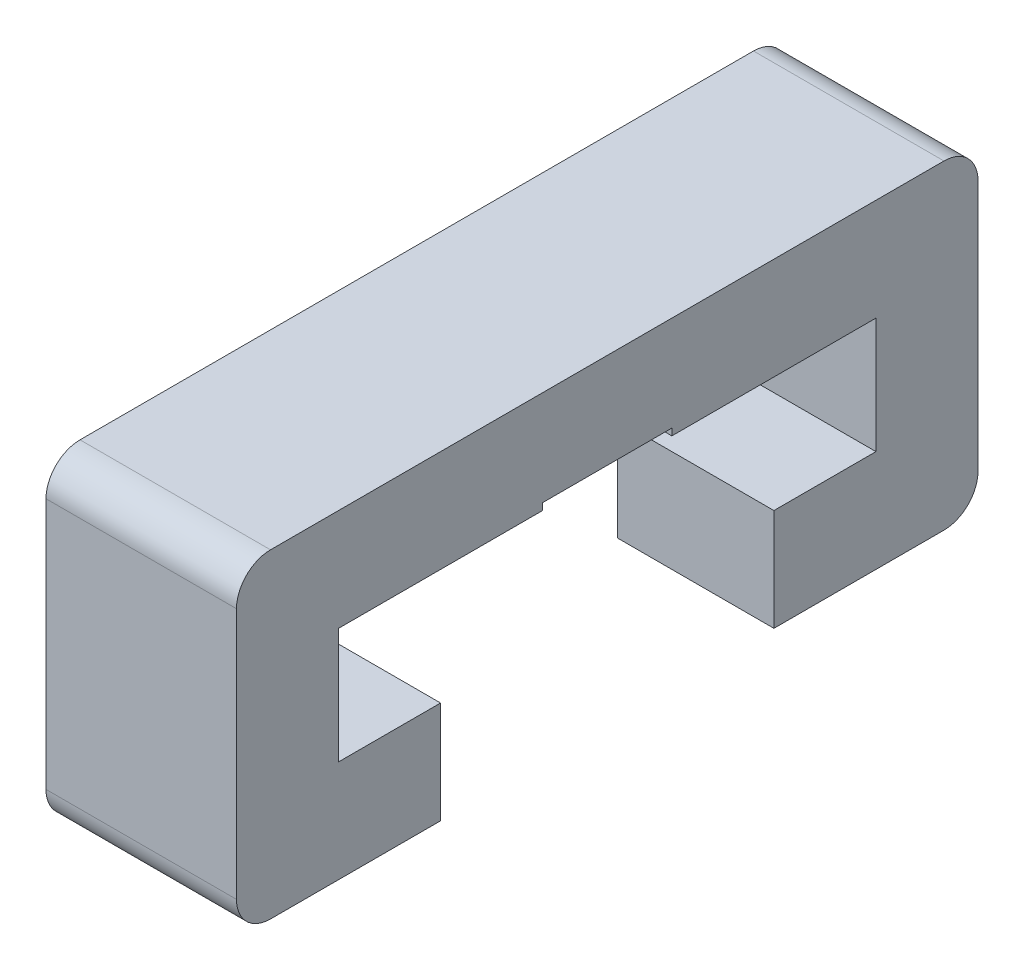
ISO-10303-21;
HEADER;
FILE_DESCRIPTION(('STEP AP214'),'2;1');
FILE_NAME('part.step','',(''),(''),'','','');
FILE_SCHEMA(('AUTOMOTIVE_DESIGN { 1 0 10303 214 1 1 1 1 }'));
ENDSEC;
DATA;
#1=APPLICATION_CONTEXT('core data for automotive mechanical design processes');
#2=APPLICATION_PROTOCOL_DEFINITION('international standard','automotive_design',2000,#1);
#3=PRODUCT_CONTEXT('',#1,'mechanical');
#4=PRODUCT('Part','Part','',(#3));
#5=PRODUCT_RELATED_PRODUCT_CATEGORY('part','',(#4));
#6=PRODUCT_DEFINITION_FORMATION('','',#4);
#7=PRODUCT_DEFINITION_CONTEXT('part definition',#1,'design');
#8=PRODUCT_DEFINITION('design','',#6,#7);
#9=PRODUCT_DEFINITION_SHAPE('','',#8);
#10=(LENGTH_UNIT() NAMED_UNIT(*) SI_UNIT(.MILLI.,.METRE.));
#11=(NAMED_UNIT(*) PLANE_ANGLE_UNIT() SI_UNIT($,.RADIAN.));
#12=(NAMED_UNIT(*) SI_UNIT($,.STERADIAN.) SOLID_ANGLE_UNIT());
#13=UNCERTAINTY_MEASURE_WITH_UNIT(LENGTH_MEASURE(1.E-05),#10,'distance_accuracy_value','');
#14=(GEOMETRIC_REPRESENTATION_CONTEXT(3) GLOBAL_UNCERTAINTY_ASSIGNED_CONTEXT((#13)) GLOBAL_UNIT_ASSIGNED_CONTEXT((#10,
#11,#12)) REPRESENTATION_CONTEXT('',''));
#15=CARTESIAN_POINT('',(0.,0.,0.));
#16=DIRECTION('',(0.,0.,1.));
#17=DIRECTION('',(1.,0.,0.));
#18=AXIS2_PLACEMENT_3D('',#15,#16,#17);
#19=CARTESIAN_POINT('',(-2.8,2.19999999999999,0.));
#20=DIRECTION('',(0.,-1.,0.));
#21=DIRECTION('',(0.,0.,-1.));
#22=AXIS2_PLACEMENT_3D('',#19,#20,#21);
#23=PLANE('',#22);
#24=DIRECTION('',(1.,0.,0.));
#25=VECTOR('',#24,1.);
#26=CARTESIAN_POINT('',(-2.8,2.19999999999999,-2.45));
#27=LINE('',#26,#25);
#28=CARTESIAN_POINT('',(-2.3,2.19999999999999,-2.45));
#29=VERTEX_POINT('',#28);
#30=CARTESIAN_POINT('',(0.,2.19999999999999,-2.45));
#31=VERTEX_POINT('',#30);
#32=EDGE_CURVE('E260',#29,#31,#27,.T.);
#33=ORIENTED_EDGE('',*,*,#32,.F.);
#34=DIRECTION('',(-0.707106781186549,0.,-0.707106781186546));
#35=VECTOR('',#34,1.);
#36=CARTESIAN_POINT('',(-1.325,2.19999999999999,-1.47500000000001));
#37=LINE('',#36,#35);
#38=CARTESIAN_POINT('',(-2.8,2.19999999999999,-2.95));
#39=VERTEX_POINT('',#38);
#40=EDGE_CURVE('E259',#29,#39,#37,.T.);
#41=ORIENTED_EDGE('',*,*,#40,.T.);
#42=DIRECTION('',(0.,0.,-1.));
#43=VECTOR('',#42,1.);
#44=CARTESIAN_POINT('',(-2.8,2.19999999999999,0.));
#45=LINE('',#44,#43);
#46=CARTESIAN_POINT('',(-2.8,2.19999999999999,-4.95));
#47=VERTEX_POINT('',#46);
#48=EDGE_CURVE('E376',#39,#47,#45,.T.);
#49=ORIENTED_EDGE('',*,*,#48,.T.);
#50=DIRECTION('',(1.,0.,0.));
#51=VECTOR('',#50,1.);
#52=CARTESIAN_POINT('',(-2.8,2.19999999999999,-4.95));
#53=LINE('',#52,#51);
#54=CARTESIAN_POINT('',(0.,2.19999999999999,-4.95));
#55=VERTEX_POINT('',#54);
#56=EDGE_CURVE('E253',#47,#55,#53,.T.);
#57=ORIENTED_EDGE('',*,*,#56,.T.);
#58=DIRECTION('',(0.,0.,-1.));
#59=VECTOR('',#58,1.);
#60=CARTESIAN_POINT('',(0.,2.19999999999999,0.));
#61=LINE('',#60,#59);
#62=EDGE_CURVE('E324',#31,#55,#61,.T.);
#63=ORIENTED_EDGE('',*,*,#62,.F.);
#64=EDGE_LOOP('',(#33,#41,#49,#57,#63));
#65=FACE_BOUND('',#64,.T.);
#66=ADVANCED_FACE('F35',(#65),#23,.T.);
#67=CARTESIAN_POINT('',(-2.8,0.,-2.45));
#68=DIRECTION('',(0.,0.,1.));
#69=DIRECTION('',(1.,0.,0.));
#70=AXIS2_PLACEMENT_3D('',#67,#68,#69);
#71=PLANE('',#70);
#72=DIRECTION('',(1.,0.,0.));
#73=VECTOR('',#72,1.);
#74=CARTESIAN_POINT('',(-2.8,3.69999999999999,-2.45));
#75=LINE('',#74,#73);
#76=CARTESIAN_POINT('',(-2.3,3.69999999999999,-2.45));
#77=VERTEX_POINT('',#76);
#78=CARTESIAN_POINT('',(0.,3.69999999999999,-2.45));
#79=VERTEX_POINT('',#78);
#80=EDGE_CURVE('E378',#77,#79,#75,.T.);
#81=ORIENTED_EDGE('',*,*,#80,.F.);
#82=DIRECTION('',(0.,-1.,0.));
#83=VECTOR('',#82,1.);
#84=CARTESIAN_POINT('',(-2.3,2.19999999999999,-2.45));
#85=LINE('',#84,#83);
#86=EDGE_CURVE('E256',#77,#29,#85,.T.);
#87=ORIENTED_EDGE('',*,*,#86,.T.);
#88=ORIENTED_EDGE('',*,*,#32,.T.);
#89=DIRECTION('',(0.,-1.,0.));
#90=VECTOR('',#89,1.);
#91=CARTESIAN_POINT('',(0.,0.,-2.45));
#92=LINE('',#91,#90);
#93=EDGE_CURVE('E373',#79,#31,#92,.T.);
#94=ORIENTED_EDGE('',*,*,#93,.F.);
#95=EDGE_LOOP('',(#81,#87,#88,#94));
#96=FACE_BOUND('',#95,.T.);
#97=ADVANCED_FACE('F403',(#96),#71,.T.);
#98=CARTESIAN_POINT('',(-2.8,3.69999999999999,0.));
#99=DIRECTION('',(0.,1.,0.));
#100=DIRECTION('',(0.,0.,1.));
#101=AXIS2_PLACEMENT_3D('',#98,#99,#100);
#102=PLANE('',#101);
#103=DIRECTION('',(1.,0.,0.));
#104=VECTOR('',#103,1.);
#105=CARTESIAN_POINT('',(-2.8,3.69999999999999,-3.95));
#106=LINE('',#105,#104);
#107=CARTESIAN_POINT('',(-2.3,3.69999999999999,-3.95));
#108=VERTEX_POINT('',#107);
#109=CARTESIAN_POINT('',(0.,3.69999999999999,-3.95));
#110=VERTEX_POINT('',#109);
#111=EDGE_CURVE('E380',#108,#110,#106,.T.);
#112=ORIENTED_EDGE('',*,*,#111,.F.);
#113=DIRECTION('',(0.,0.,1.));
#114=VECTOR('',#113,1.);
#115=CARTESIAN_POINT('',(-2.3,3.69999999999999,-2.45));
#116=LINE('',#115,#114);
#117=EDGE_CURVE('E276',#108,#77,#116,.T.);
#118=ORIENTED_EDGE('',*,*,#117,.T.);
#119=ORIENTED_EDGE('',*,*,#80,.T.);
#120=DIRECTION('',(0.,0.,1.));
#121=VECTOR('',#120,1.);
#122=CARTESIAN_POINT('',(0.,3.69999999999999,0.));
#123=LINE('',#122,#121);
#124=EDGE_CURVE('E370',#110,#79,#123,.T.);
#125=ORIENTED_EDGE('',*,*,#124,.F.);
#126=EDGE_LOOP('',(#112,#118,#119,#125));
#127=FACE_BOUND('',#126,.T.);
#128=ADVANCED_FACE('F399',(#127),#102,.T.);
#129=CARTESIAN_POINT('',(-2.8,0.,-3.95));
#130=DIRECTION('',(0.,0.,1.));
#131=DIRECTION('',(1.,0.,0.));
#132=AXIS2_PLACEMENT_3D('',#129,#130,#131);
#133=PLANE('',#132);
#134=DIRECTION('',(1.,0.,0.));
#135=VECTOR('',#134,1.);
#136=CARTESIAN_POINT('',(-2.8,5.39999999999999,-3.95));
#137=LINE('',#136,#135);
#138=CARTESIAN_POINT('',(-2.3,5.39999999999999,-3.95));
#139=VERTEX_POINT('',#138);
#140=CARTESIAN_POINT('',(0.,5.39999999999999,-3.95));
#141=VERTEX_POINT('',#140);
#142=EDGE_CURVE('E220',#139,#141,#137,.T.);
#143=ORIENTED_EDGE('',*,*,#142,.F.);
#144=DIRECTION('',(0.,-1.,0.));
#145=VECTOR('',#144,1.);
#146=CARTESIAN_POINT('',(-2.3,3.69999999999999,-3.95));
#147=LINE('',#146,#145);
#148=EDGE_CURVE('E278',#139,#108,#147,.T.);
#149=ORIENTED_EDGE('',*,*,#148,.T.);
#150=ORIENTED_EDGE('',*,*,#111,.T.);
#151=DIRECTION('',(0.,-1.,0.));
#152=VECTOR('',#151,1.);
#153=CARTESIAN_POINT('',(0.,0.,-3.95));
#154=LINE('',#153,#152);
#155=EDGE_CURVE('E367',#141,#110,#154,.T.);
#156=ORIENTED_EDGE('',*,*,#155,.F.);
#157=EDGE_LOOP('',(#143,#149,#150,#156));
#158=FACE_BOUND('',#157,.T.);
#159=ADVANCED_FACE('F393',(#158),#133,.T.);
#160=CARTESIAN_POINT('',(-2.8,5.39999999999999,0.));
#161=DIRECTION('',(0.,1.,0.));
#162=DIRECTION('',(0.,0.,1.));
#163=AXIS2_PLACEMENT_3D('',#160,#161,#162);
#164=PLANE('',#163);
#165=DIRECTION('',(1.,0.,0.));
#166=VECTOR('',#165,1.);
#167=CARTESIAN_POINT('',(-2.8,5.39999999999999,3.95));
#168=LINE('',#167,#166);
#169=CARTESIAN_POINT('',(-2.3,5.39999999999999,3.95));
#170=VERTEX_POINT('',#169);
#171=CARTESIAN_POINT('',(0.,5.39999999999999,3.95));
#172=VERTEX_POINT('',#171);
#173=EDGE_CURVE('E227',#170,#172,#168,.T.);
#174=ORIENTED_EDGE('',*,*,#173,.F.);
#175=DIRECTION('',(0.,0.,-1.));
#176=VECTOR('',#175,1.);
#177=CARTESIAN_POINT('',(-2.3,5.39999999999999,0.));
#178=LINE('',#177,#176);
#179=EDGE_CURVE('E280',#170,#139,#178,.T.);
#180=ORIENTED_EDGE('',*,*,#179,.T.);
#181=ORIENTED_EDGE('',*,*,#142,.T.);
#182=DIRECTION('',(0.,0.,1.));
#183=VECTOR('',#182,1.);
#184=CARTESIAN_POINT('',(0.,5.39999999999999,0.));
#185=LINE('',#184,#183);
#186=CARTESIAN_POINT('',(0.,5.39999999999999,-0.95));
#187=VERTEX_POINT('',#186);
#188=EDGE_CURVE('E361',#141,#187,#185,.T.);
#189=ORIENTED_EDGE('',*,*,#188,.T.);
#190=DIRECTION('',(1.,0.,0.));
#191=VECTOR('',#190,1.);
#192=CARTESIAN_POINT('',(-2.8,5.39999999999999,-0.95));
#193=LINE('',#192,#191);
#194=CARTESIAN_POINT('',(-1.55980762113533,5.39999999999999,-0.95));
#195=VERTEX_POINT('',#194);
#196=EDGE_CURVE('E218',#195,#187,#193,.T.);
#197=ORIENTED_EDGE('',*,*,#196,.F.);
#198=DIRECTION('',(0.,0.,1.));
#199=VECTOR('',#198,1.);
#200=CARTESIAN_POINT('',(-1.55980762113533,5.39999999999999,0.));
#201=LINE('',#200,#199);
#202=CARTESIAN_POINT('',(-1.55980762113533,5.39999999999999,0.95));
#203=VERTEX_POINT('',#202);
#204=EDGE_CURVE('E201',#195,#203,#201,.T.);
#205=ORIENTED_EDGE('',*,*,#204,.T.);
#206=DIRECTION('',(1.,0.,0.));
#207=VECTOR('',#206,1.);
#208=CARTESIAN_POINT('',(-2.8,5.39999999999999,0.95));
#209=LINE('',#208,#207);
#210=CARTESIAN_POINT('',(0.,5.39999999999999,0.95));
#211=VERTEX_POINT('',#210);
#212=EDGE_CURVE('E222',#203,#211,#209,.T.);
#213=ORIENTED_EDGE('',*,*,#212,.T.);
#214=EDGE_CURVE('E357',#211,#172,#185,.T.);
#215=ORIENTED_EDGE('',*,*,#214,.T.);
#216=EDGE_LOOP('',(#174,#180,#181,#189,#197,#205,#213,#215));
#217=FACE_BOUND('',#216,.T.);
#218=ADVANCED_FACE('F386',(#217),#164,.F.);
#219=CARTESIAN_POINT('',(-2.8,0.,-0.95));
#220=DIRECTION('',(0.,0.,-1.));
#221=DIRECTION('',(-1.,0.,0.));
#222=AXIS2_PLACEMENT_3D('',#219,#220,#221);
#223=PLANE('',#222);
#224=DIRECTION('',(1.,0.,0.));
#225=VECTOR('',#224,1.);
#226=CARTESIAN_POINT('',(-2.8,5.49999999999999,-0.95));
#227=LINE('',#226,#225);
#228=CARTESIAN_POINT('',(-1.55980762113533,5.49999999999999,-0.95));
#229=VERTEX_POINT('',#228);
#230=CARTESIAN_POINT('',(0.,5.49999999999999,-0.95));
#231=VERTEX_POINT('',#230);
#232=EDGE_CURVE('E210',#229,#231,#227,.T.);
#233=ORIENTED_EDGE('',*,*,#232,.F.);
#234=DIRECTION('',(0.,1.,0.));
#235=VECTOR('',#234,1.);
#236=CARTESIAN_POINT('',(-1.55980762113533,0.,-0.95));
#237=LINE('',#236,#235);
#238=EDGE_CURVE('E195',#195,#229,#237,.T.);
#239=ORIENTED_EDGE('',*,*,#238,.F.);
#240=ORIENTED_EDGE('',*,*,#196,.T.);
#241=DIRECTION('',(0.,1.,0.));
#242=VECTOR('',#241,1.);
#243=CARTESIAN_POINT('',(0.,0.,-0.95));
#244=LINE('',#243,#242);
#245=EDGE_CURVE('E216',#187,#231,#244,.T.);
#246=ORIENTED_EDGE('',*,*,#245,.T.);
#247=EDGE_LOOP('',(#233,#239,#240,#246));
#248=FACE_BOUND('',#247,.T.);
#249=ADVANCED_FACE('F214',(#248),#223,.F.);
#250=CARTESIAN_POINT('',(-2.8,5.49999999999999,0.));
#251=DIRECTION('',(0.,-1.,0.));
#252=DIRECTION('',(0.,0.,-1.));
#253=AXIS2_PLACEMENT_3D('',#250,#251,#252);
#254=PLANE('',#253);
#255=DIRECTION('',(0.,0.,-1.));
#256=VECTOR('',#255,1.);
#257=CARTESIAN_POINT('',(-1.55980762113533,5.49999999999999,0.));
#258=LINE('',#257,#256);
#259=CARTESIAN_POINT('',(-1.55980762113533,5.49999999999999,0.95));
#260=VERTEX_POINT('',#259);
#261=EDGE_CURVE('E199',#260,#229,#258,.T.);
#262=ORIENTED_EDGE('',*,*,#261,.T.);
#263=ORIENTED_EDGE('',*,*,#232,.T.);
#264=DIRECTION('',(0.,0.,-1.));
#265=VECTOR('',#264,1.);
#266=CARTESIAN_POINT('',(0.,5.49999999999999,0.));
#267=LINE('',#266,#265);
#268=CARTESIAN_POINT('',(0.,5.49999999999999,0.95));
#269=VERTEX_POINT('',#268);
#270=EDGE_CURVE('E364',#269,#231,#267,.T.);
#271=ORIENTED_EDGE('',*,*,#270,.F.);
#272=DIRECTION('',(1.,0.,0.));
#273=VECTOR('',#272,1.);
#274=CARTESIAN_POINT('',(-2.8,5.49999999999999,0.95));
#275=LINE('',#274,#273);
#276=EDGE_CURVE('E212',#260,#269,#275,.T.);
#277=ORIENTED_EDGE('',*,*,#276,.F.);
#278=EDGE_LOOP('',(#262,#263,#271,#277));
#279=FACE_BOUND('',#278,.T.);
#280=ADVANCED_FACE('F208',(#279),#254,.T.);
#281=CARTESIAN_POINT('',(-2.8,0.,0.95));
#282=DIRECTION('',(0.,0.,-1.));
#283=DIRECTION('',(-1.,0.,0.));
#284=AXIS2_PLACEMENT_3D('',#281,#282,#283);
#285=PLANE('',#284);
#286=DIRECTION('',(0.,1.,0.));
#287=VECTOR('',#286,1.);
#288=CARTESIAN_POINT('',(-1.55980762113533,0.,0.95));
#289=LINE('',#288,#287);
#290=EDGE_CURVE('E328',#203,#260,#289,.T.);
#291=ORIENTED_EDGE('',*,*,#290,.T.);
#292=ORIENTED_EDGE('',*,*,#276,.T.);
#293=DIRECTION('',(0.,1.,0.));
#294=VECTOR('',#293,1.);
#295=CARTESIAN_POINT('',(0.,0.,0.95));
#296=LINE('',#295,#294);
#297=EDGE_CURVE('E360',#211,#269,#296,.T.);
#298=ORIENTED_EDGE('',*,*,#297,.F.);
#299=ORIENTED_EDGE('',*,*,#212,.F.);
#300=EDGE_LOOP('',(#291,#292,#298,#299));
#301=FACE_BOUND('',#300,.T.);
#302=ADVANCED_FACE('F463',(#301),#285,.T.);
#303=CARTESIAN_POINT('',(-2.8,0.,3.95));
#304=DIRECTION('',(0.,0.,1.));
#305=DIRECTION('',(1.,0.,0.));
#306=AXIS2_PLACEMENT_3D('',#303,#304,#305);
#307=PLANE('',#306);
#308=DIRECTION('',(1.,0.,0.));
#309=VECTOR('',#308,1.);
#310=CARTESIAN_POINT('',(-2.8,3.69999999999999,3.95));
#311=LINE('',#310,#309);
#312=CARTESIAN_POINT('',(-2.3,3.69999999999999,3.95));
#313=VERTEX_POINT('',#312);
#314=CARTESIAN_POINT('',(0.,3.69999999999999,3.95));
#315=VERTEX_POINT('',#314);
#316=EDGE_CURVE('E229',#313,#315,#311,.T.);
#317=ORIENTED_EDGE('',*,*,#316,.F.);
#318=DIRECTION('',(0.,1.,0.));
#319=VECTOR('',#318,1.);
#320=CARTESIAN_POINT('',(-2.3,0.,3.95));
#321=LINE('',#320,#319);
#322=EDGE_CURVE('E282',#313,#170,#321,.T.);
#323=ORIENTED_EDGE('',*,*,#322,.T.);
#324=ORIENTED_EDGE('',*,*,#173,.T.);
#325=DIRECTION('',(0.,-1.,0.));
#326=VECTOR('',#325,1.);
#327=CARTESIAN_POINT('',(0.,0.,3.95));
#328=LINE('',#327,#326);
#329=EDGE_CURVE('E354',#172,#315,#328,.T.);
#330=ORIENTED_EDGE('',*,*,#329,.T.);
#331=EDGE_LOOP('',(#317,#323,#324,#330));
#332=FACE_BOUND('',#331,.T.);
#333=ADVANCED_FACE('F517',(#332),#307,.F.);
#334=CARTESIAN_POINT('',(-2.8,3.69999999999999,0.));
#335=DIRECTION('',(0.,-1.,0.));
#336=DIRECTION('',(0.,0.,-1.));
#337=AXIS2_PLACEMENT_3D('',#334,#335,#336);
#338=PLANE('',#337);
#339=DIRECTION('',(1.,0.,0.));
#340=VECTOR('',#339,1.);
#341=CARTESIAN_POINT('',(-2.8,3.69999999999999,2.45));
#342=LINE('',#341,#340);
#343=CARTESIAN_POINT('',(-2.3,3.69999999999999,2.45));
#344=VERTEX_POINT('',#343);
#345=CARTESIAN_POINT('',(0.,3.69999999999999,2.45));
#346=VERTEX_POINT('',#345);
#347=EDGE_CURVE('E231',#344,#346,#342,.T.);
#348=ORIENTED_EDGE('',*,*,#347,.F.);
#349=DIRECTION('',(0.,0.,1.));
#350=VECTOR('',#349,1.);
#351=CARTESIAN_POINT('',(-2.3,3.69999999999999,0.));
#352=LINE('',#351,#350);
#353=EDGE_CURVE('E284',#344,#313,#352,.T.);
#354=ORIENTED_EDGE('',*,*,#353,.T.);
#355=ORIENTED_EDGE('',*,*,#316,.T.);
#356=DIRECTION('',(0.,0.,-1.));
#357=VECTOR('',#356,1.);
#358=CARTESIAN_POINT('',(0.,3.69999999999999,0.));
#359=LINE('',#358,#357);
#360=EDGE_CURVE('E351',#315,#346,#359,.T.);
#361=ORIENTED_EDGE('',*,*,#360,.T.);
#362=EDGE_LOOP('',(#348,#354,#355,#361));
#363=FACE_BOUND('',#362,.T.);
#364=ADVANCED_FACE('F514',(#363),#338,.F.);
#365=CARTESIAN_POINT('',(-2.8,0.,2.45));
#366=DIRECTION('',(0.,0.,1.));
#367=DIRECTION('',(1.,0.,0.));
#368=AXIS2_PLACEMENT_3D('',#365,#366,#367);
#369=PLANE('',#368);
#370=DIRECTION('',(1.,0.,0.));
#371=VECTOR('',#370,1.);
#372=CARTESIAN_POINT('',(-2.8,2.19999999999999,2.45));
#373=LINE('',#372,#371);
#374=CARTESIAN_POINT('',(-2.3,2.19999999999999,2.45));
#375=VERTEX_POINT('',#374);
#376=CARTESIAN_POINT('',(0.,2.19999999999999,2.45));
#377=VERTEX_POINT('',#376);
#378=EDGE_CURVE('E233',#375,#377,#373,.T.);
#379=ORIENTED_EDGE('',*,*,#378,.F.);
#380=DIRECTION('',(0.,1.,0.));
#381=VECTOR('',#380,1.);
#382=CARTESIAN_POINT('',(-2.3,0.,2.45));
#383=LINE('',#382,#381);
#384=EDGE_CURVE('E11',#375,#344,#383,.T.);
#385=ORIENTED_EDGE('',*,*,#384,.T.);
#386=ORIENTED_EDGE('',*,*,#347,.T.);
#387=DIRECTION('',(0.,-1.,0.));
#388=VECTOR('',#387,1.);
#389=CARTESIAN_POINT('',(0.,0.,2.45));
#390=LINE('',#389,#388);
#391=EDGE_CURVE('E348',#346,#377,#390,.T.);
#392=ORIENTED_EDGE('',*,*,#391,.T.);
#393=EDGE_LOOP('',(#379,#385,#386,#392));
#394=FACE_BOUND('',#393,.T.);
#395=ADVANCED_FACE('F511',(#394),#369,.F.);
#396=CARTESIAN_POINT('',(-2.8,2.19999999999999,0.));
#397=DIRECTION('',(0.,1.,0.));
#398=DIRECTION('',(0.,0.,1.));
#399=AXIS2_PLACEMENT_3D('',#396,#397,#398);
#400=PLANE('',#399);
#401=DIRECTION('',(0.,0.,1.));
#402=VECTOR('',#401,1.);
#403=CARTESIAN_POINT('',(-2.8,2.19999999999999,0.));
#404=LINE('',#403,#402);
#405=CARTESIAN_POINT('',(-2.8,2.19999999999999,2.95));
#406=VERTEX_POINT('',#405);
#407=CARTESIAN_POINT('',(-2.8,2.19999999999999,4.95));
#408=VERTEX_POINT('',#407);
#409=EDGE_CURVE('E255',#406,#408,#404,.T.);
#410=ORIENTED_EDGE('',*,*,#409,.F.);
#411=DIRECTION('',(-0.707106781186549,0.,0.707106781186546));
#412=VECTOR('',#411,1.);
#413=CARTESIAN_POINT('',(-2.8,2.19999999999999,2.95));
#414=LINE('',#413,#412);
#415=EDGE_CURVE('E44',#406,#375,#414,.F.);
#416=ORIENTED_EDGE('',*,*,#415,.T.);
#417=ORIENTED_EDGE('',*,*,#378,.T.);
#418=DIRECTION('',(0.,0.,1.));
#419=VECTOR('',#418,1.);
#420=CARTESIAN_POINT('',(0.,2.19999999999999,0.));
#421=LINE('',#420,#419);
#422=CARTESIAN_POINT('',(0.,2.19999999999999,4.95));
#423=VERTEX_POINT('',#422);
#424=EDGE_CURVE('E346',#377,#423,#421,.T.);
#425=ORIENTED_EDGE('',*,*,#424,.T.);
#426=DIRECTION('',(1.,0.,0.));
#427=VECTOR('',#426,1.);
#428=CARTESIAN_POINT('',(-2.8,2.19999999999999,4.95));
#429=LINE('',#428,#427);
#430=EDGE_CURVE('E235',#408,#423,#429,.T.);
#431=ORIENTED_EDGE('',*,*,#430,.F.);
#432=EDGE_LOOP('',(#410,#416,#417,#425,#431));
#433=FACE_BOUND('',#432,.T.);
#434=ADVANCED_FACE('F316',(#433),#400,.F.);
#435=CARTESIAN_POINT('',(-2.8,2.69999999999999,4.95));
#436=DIRECTION('',(1.,0.,0.));
#437=DIRECTION('',(0.,0.,-1.));
#438=AXIS2_PLACEMENT_3D('',#435,#436,#437);
#439=CYLINDRICAL_SURFACE('',#438,0.5);
#440=CARTESIAN_POINT('',(0.,2.69999999999999,4.95));
#441=DIRECTION('',(1.,0.,0.));
#442=DIRECTION('',(0.,0.,-1.));
#443=AXIS2_PLACEMENT_3D('',#440,#441,#442);
#444=CIRCLE('',#443,0.5);
#445=CARTESIAN_POINT('',(0.,2.7,5.45));
#446=VERTEX_POINT('',#445);
#447=EDGE_CURVE('E344',#423,#446,#444,.F.);
#448=ORIENTED_EDGE('',*,*,#447,.T.);
#449=DIRECTION('',(1.,0.,0.));
#450=VECTOR('',#449,1.);
#451=CARTESIAN_POINT('',(-2.8,2.7,5.45));
#452=LINE('',#451,#450);
#453=CARTESIAN_POINT('',(-2.8,2.7,5.45));
#454=VERTEX_POINT('',#453);
#455=EDGE_CURVE('E238',#454,#446,#452,.T.);
#456=ORIENTED_EDGE('',*,*,#455,.F.);
#457=CARTESIAN_POINT('',(-2.8,2.69999999999999,4.95));
#458=DIRECTION('',(1.,0.,0.));
#459=DIRECTION('',(0.,0.,-1.));
#460=AXIS2_PLACEMENT_3D('',#457,#458,#459);
#461=CIRCLE('',#460,0.5);
#462=EDGE_CURVE('E318',#408,#454,#461,.F.);
#463=ORIENTED_EDGE('',*,*,#462,.F.);
#464=ORIENTED_EDGE('',*,*,#430,.T.);
#465=EDGE_LOOP('',(#448,#456,#463,#464));
#466=FACE_BOUND('',#465,.T.);
#467=ADVANCED_FACE('F449',(#466),#439,.T.);
#468=CARTESIAN_POINT('',(-2.8,0.,5.45));
#469=DIRECTION('',(0.,0.,-1.));
#470=DIRECTION('',(-1.,0.,0.));
#471=AXIS2_PLACEMENT_3D('',#468,#469,#470);
#472=PLANE('',#471);
#473=DIRECTION('',(0.,1.,0.));
#474=VECTOR('',#473,1.);
#475=CARTESIAN_POINT('',(0.,0.,5.45));
#476=LINE('',#475,#474);
#477=CARTESIAN_POINT('',(0.,6.39999999999999,5.45));
#478=VERTEX_POINT('',#477);
#479=EDGE_CURVE('E342',#446,#478,#476,.T.);
#480=ORIENTED_EDGE('',*,*,#479,.T.);
#481=DIRECTION('',(1.,0.,0.));
#482=VECTOR('',#481,1.);
#483=CARTESIAN_POINT('',(-2.8,6.39999999999999,5.45));
#484=LINE('',#483,#482);
#485=CARTESIAN_POINT('',(-2.8,6.39999999999999,5.45));
#486=VERTEX_POINT('',#485);
#487=EDGE_CURVE('E241',#486,#478,#484,.T.);
#488=ORIENTED_EDGE('',*,*,#487,.F.);
#489=DIRECTION('',(0.,1.,0.));
#490=VECTOR('',#489,1.);
#491=CARTESIAN_POINT('',(-2.8,0.,5.45));
#492=LINE('',#491,#490);
#493=EDGE_CURVE('E320',#454,#486,#492,.T.);
#494=ORIENTED_EDGE('',*,*,#493,.F.);
#495=ORIENTED_EDGE('',*,*,#455,.T.);
#496=EDGE_LOOP('',(#480,#488,#494,#495));
#497=FACE_BOUND('',#496,.T.);
#498=ADVANCED_FACE('F443',(#497),#472,.F.);
#499=CARTESIAN_POINT('',(-2.8,6.39999999999999,4.95));
#500=DIRECTION('',(1.,0.,0.));
#501=DIRECTION('',(0.,0.,-1.));
#502=AXIS2_PLACEMENT_3D('',#499,#500,#501);
#503=CYLINDRICAL_SURFACE('',#502,0.5);
#504=CARTESIAN_POINT('',(0.,6.39999999999999,4.95));
#505=DIRECTION('',(1.,0.,0.));
#506=DIRECTION('',(0.,0.,-1.));
#507=AXIS2_PLACEMENT_3D('',#504,#505,#506);
#508=CIRCLE('',#507,0.5);
#509=CARTESIAN_POINT('',(0.,6.89999999999999,4.95));
#510=VERTEX_POINT('',#509);
#511=EDGE_CURVE('E340',#478,#510,#508,.F.);
#512=ORIENTED_EDGE('',*,*,#511,.T.);
#513=DIRECTION('',(1.,0.,0.));
#514=VECTOR('',#513,1.);
#515=CARTESIAN_POINT('',(-2.8,6.89999999999999,4.95));
#516=LINE('',#515,#514);
#517=CARTESIAN_POINT('',(-2.8,6.89999999999999,4.95));
#518=VERTEX_POINT('',#517);
#519=EDGE_CURVE('E244',#518,#510,#516,.T.);
#520=ORIENTED_EDGE('',*,*,#519,.F.);
#521=CARTESIAN_POINT('',(-2.8,6.39999999999999,4.95));
#522=DIRECTION('',(1.,0.,0.));
#523=DIRECTION('',(0.,0.,-1.));
#524=AXIS2_PLACEMENT_3D('',#521,#522,#523);
#525=CIRCLE('',#524,0.5);
#526=EDGE_CURVE('E439',#486,#518,#525,.F.);
#527=ORIENTED_EDGE('',*,*,#526,.F.);
#528=ORIENTED_EDGE('',*,*,#487,.T.);
#529=EDGE_LOOP('',(#512,#520,#527,#528));
#530=FACE_BOUND('',#529,.T.);
#531=ADVANCED_FACE('F438',(#530),#503,.T.);
#532=CARTESIAN_POINT('',(-2.8,6.89999999999999,0.));
#533=DIRECTION('',(0.,-1.,0.));
#534=DIRECTION('',(0.,0.,-1.));
#535=AXIS2_PLACEMENT_3D('',#532,#533,#534);
#536=PLANE('',#535);
#537=DIRECTION('',(0.,0.,-1.));
#538=VECTOR('',#537,1.);
#539=CARTESIAN_POINT('',(0.,6.89999999999999,0.));
#540=LINE('',#539,#538);
#541=CARTESIAN_POINT('',(0.,6.89999999999999,-4.95));
#542=VERTEX_POINT('',#541);
#543=EDGE_CURVE('E337',#510,#542,#540,.T.);
#544=ORIENTED_EDGE('',*,*,#543,.T.);
#545=DIRECTION('',(1.,0.,0.));
#546=VECTOR('',#545,1.);
#547=CARTESIAN_POINT('',(-2.8,6.89999999999999,-4.95));
#548=LINE('',#547,#546);
#549=CARTESIAN_POINT('',(-2.8,6.89999999999999,-4.95));
#550=VERTEX_POINT('',#549);
#551=EDGE_CURVE('E247',#550,#542,#548,.T.);
#552=ORIENTED_EDGE('',*,*,#551,.F.);
#553=DIRECTION('',(0.,0.,-1.));
#554=VECTOR('',#553,1.);
#555=CARTESIAN_POINT('',(-2.8,6.89999999999999,0.));
#556=LINE('',#555,#554);
#557=EDGE_CURVE('E435',#518,#550,#556,.T.);
#558=ORIENTED_EDGE('',*,*,#557,.F.);
#559=ORIENTED_EDGE('',*,*,#519,.T.);
#560=EDGE_LOOP('',(#544,#552,#558,#559));
#561=FACE_BOUND('',#560,.T.);
#562=ADVANCED_FACE('F432',(#561),#536,.F.);
#563=CARTESIAN_POINT('',(-2.8,6.39999999999999,-4.95));
#564=DIRECTION('',(1.,0.,0.));
#565=DIRECTION('',(0.,0.,-1.));
#566=AXIS2_PLACEMENT_3D('',#563,#564,#565);
#567=CYLINDRICAL_SURFACE('',#566,0.5);
#568=CARTESIAN_POINT('',(0.,6.39999999999999,-4.95));
#569=DIRECTION('',(1.,0.,0.));
#570=DIRECTION('',(0.,0.,-1.));
#571=AXIS2_PLACEMENT_3D('',#568,#569,#570);
#572=CIRCLE('',#571,0.5);
#573=CARTESIAN_POINT('',(0.,6.39999999999999,-5.45));
#574=VERTEX_POINT('',#573);
#575=EDGE_CURVE('E334',#574,#542,#572,.T.);
#576=ORIENTED_EDGE('',*,*,#575,.F.);
#577=DIRECTION('',(1.,0.,0.));
#578=VECTOR('',#577,1.);
#579=CARTESIAN_POINT('',(-2.8,6.39999999999999,-5.45));
#580=LINE('',#579,#578);
#581=CARTESIAN_POINT('',(-2.8,6.39999999999999,-5.45));
#582=VERTEX_POINT('',#581);
#583=EDGE_CURVE('E249',#582,#574,#580,.T.);
#584=ORIENTED_EDGE('',*,*,#583,.F.);
#585=CARTESIAN_POINT('',(-2.8,6.39999999999999,-4.95));
#586=DIRECTION('',(1.,0.,0.));
#587=DIRECTION('',(0.,0.,-1.));
#588=AXIS2_PLACEMENT_3D('',#585,#586,#587);
#589=CIRCLE('',#588,0.5);
#590=EDGE_CURVE('E453',#582,#550,#589,.T.);
#591=ORIENTED_EDGE('',*,*,#590,.T.);
#592=ORIENTED_EDGE('',*,*,#551,.T.);
#593=EDGE_LOOP('',(#576,#584,#591,#592));
#594=FACE_BOUND('',#593,.T.);
#595=ADVANCED_FACE('F426',(#594),#567,.T.);
#596=CARTESIAN_POINT('',(-2.8,0.,-5.45));
#597=DIRECTION('',(0.,0.,-1.));
#598=DIRECTION('',(-1.,0.,0.));
#599=AXIS2_PLACEMENT_3D('',#596,#597,#598);
#600=PLANE('',#599);
#601=DIRECTION('',(0.,1.,0.));
#602=VECTOR('',#601,1.);
#603=CARTESIAN_POINT('',(0.,0.,-5.45));
#604=LINE('',#603,#602);
#605=CARTESIAN_POINT('',(0.,2.7,-5.45));
#606=VERTEX_POINT('',#605);
#607=EDGE_CURVE('E331',#606,#574,#604,.T.);
#608=ORIENTED_EDGE('',*,*,#607,.F.);
#609=DIRECTION('',(1.,0.,0.));
#610=VECTOR('',#609,1.);
#611=CARTESIAN_POINT('',(-2.8,2.7,-5.45));
#612=LINE('',#611,#610);
#613=CARTESIAN_POINT('',(-2.8,2.7,-5.45));
#614=VERTEX_POINT('',#613);
#615=EDGE_CURVE('E251',#614,#606,#612,.T.);
#616=ORIENTED_EDGE('',*,*,#615,.F.);
#617=DIRECTION('',(0.,1.,0.));
#618=VECTOR('',#617,1.);
#619=CARTESIAN_POINT('',(-2.8,0.,-5.45));
#620=LINE('',#619,#618);
#621=EDGE_CURVE('E422',#614,#582,#620,.T.);
#622=ORIENTED_EDGE('',*,*,#621,.T.);
#623=ORIENTED_EDGE('',*,*,#583,.T.);
#624=EDGE_LOOP('',(#608,#616,#622,#623));
#625=FACE_BOUND('',#624,.T.);
#626=ADVANCED_FACE('F420',(#625),#600,.T.);
#627=CARTESIAN_POINT('',(-2.8,2.69999999999999,-4.95));
#628=DIRECTION('',(1.,0.,0.));
#629=DIRECTION('',(0.,0.,-1.));
#630=AXIS2_PLACEMENT_3D('',#627,#628,#629);
#631=CYLINDRICAL_SURFACE('',#630,0.5);
#632=CARTESIAN_POINT('',(0.,2.69999999999999,-4.95));
#633=DIRECTION('',(1.,0.,0.));
#634=DIRECTION('',(0.,0.,-1.));
#635=AXIS2_PLACEMENT_3D('',#632,#633,#634);
#636=CIRCLE('',#635,0.5);
#637=EDGE_CURVE('E327',#55,#606,#636,.T.);
#638=ORIENTED_EDGE('',*,*,#637,.F.);
#639=ORIENTED_EDGE('',*,*,#56,.F.);
#640=CARTESIAN_POINT('',(-2.8,2.69999999999999,-4.95));
#641=DIRECTION('',(1.,0.,0.));
#642=DIRECTION('',(0.,0.,-1.));
#643=AXIS2_PLACEMENT_3D('',#640,#641,#642);
#644=CIRCLE('',#643,0.5);
#645=EDGE_CURVE('E416',#47,#614,#644,.T.);
#646=ORIENTED_EDGE('',*,*,#645,.T.);
#647=ORIENTED_EDGE('',*,*,#615,.T.);
#648=EDGE_LOOP('',(#638,#639,#646,#647));
#649=FACE_BOUND('',#648,.T.);
#650=ADVANCED_FACE('F413',(#649),#631,.T.);
#651=CARTESIAN_POINT('',(-2.8,0.,0.));
#652=DIRECTION('',(1.,0.,0.));
#653=DIRECTION('',(0.,0.,-1.));
#654=AXIS2_PLACEMENT_3D('',#651,#652,#653);
#655=PLANE('',#654);
#656=ORIENTED_EDGE('',*,*,#48,.F.);
#657=DIRECTION('',(0.,1.,0.));
#658=VECTOR('',#657,1.);
#659=CARTESIAN_POINT('',(-2.8,3.69999999999999,-2.95));
#660=LINE('',#659,#658);
#661=CARTESIAN_POINT('',(-2.8,3.19999999999999,-2.95));
#662=VERTEX_POINT('',#661);
#663=EDGE_CURVE('E274',#39,#662,#660,.T.);
#664=ORIENTED_EDGE('',*,*,#663,.T.);
#665=DIRECTION('',(0.,0.,-1.));
#666=VECTOR('',#665,1.);
#667=CARTESIAN_POINT('',(-2.8,3.19999999999999,-3.95));
#668=LINE('',#667,#666);
#669=CARTESIAN_POINT('',(-2.8,3.19999999999999,-4.45));
#670=VERTEX_POINT('',#669);
#671=EDGE_CURVE('E272',#662,#670,#668,.T.);
#672=ORIENTED_EDGE('',*,*,#671,.T.);
#673=DIRECTION('',(0.,1.,0.));
#674=VECTOR('',#673,1.);
#675=CARTESIAN_POINT('',(-2.8,5.39999999999999,-4.45));
#676=LINE('',#675,#674);
#677=CARTESIAN_POINT('',(-2.8,5.89999999999999,-4.45));
#678=VERTEX_POINT('',#677);
#679=EDGE_CURVE('E270',#670,#678,#676,.T.);
#680=ORIENTED_EDGE('',*,*,#679,.T.);
#681=DIRECTION('',(0.,0.,1.));
#682=VECTOR('',#681,1.);
#683=CARTESIAN_POINT('',(-2.8,5.89999999999999,0.));
#684=LINE('',#683,#682);
#685=CARTESIAN_POINT('',(-2.8,5.89999999999999,4.45));
#686=VERTEX_POINT('',#685);
#687=EDGE_CURVE('E268',#678,#686,#684,.T.);
#688=ORIENTED_EDGE('',*,*,#687,.T.);
#689=DIRECTION('',(0.,-1.,0.));
#690=VECTOR('',#689,1.);
#691=CARTESIAN_POINT('',(-2.8,0.,4.45));
#692=LINE('',#691,#690);
#693=CARTESIAN_POINT('',(-2.8,3.19999999999999,4.45));
#694=VERTEX_POINT('',#693);
#695=EDGE_CURVE('E266',#686,#694,#692,.T.);
#696=ORIENTED_EDGE('',*,*,#695,.T.);
#697=DIRECTION('',(0.,0.,-1.));
#698=VECTOR('',#697,1.);
#699=CARTESIAN_POINT('',(-2.8,3.19999999999999,0.));
#700=LINE('',#699,#698);
#701=CARTESIAN_POINT('',(-2.8,3.19999999999999,2.95));
#702=VERTEX_POINT('',#701);
#703=EDGE_CURVE('E264',#694,#702,#700,.T.);
#704=ORIENTED_EDGE('',*,*,#703,.T.);
#705=DIRECTION('',(0.,-1.,0.));
#706=VECTOR('',#705,1.);
#707=CARTESIAN_POINT('',(-2.8,0.,2.95));
#708=LINE('',#707,#706);
#709=EDGE_CURVE('E262',#702,#406,#708,.T.);
#710=ORIENTED_EDGE('',*,*,#709,.T.);
#711=ORIENTED_EDGE('',*,*,#409,.T.);
#712=ORIENTED_EDGE('',*,*,#462,.T.);
#713=ORIENTED_EDGE('',*,*,#493,.T.);
#714=ORIENTED_EDGE('',*,*,#526,.T.);
#715=ORIENTED_EDGE('',*,*,#557,.T.);
#716=ORIENTED_EDGE('',*,*,#590,.F.);
#717=ORIENTED_EDGE('',*,*,#621,.F.);
#718=ORIENTED_EDGE('',*,*,#645,.F.);
#719=EDGE_LOOP('',(#656,#664,#672,#680,#688,#696,#704,#710,#711,#712,#713,#714,#715,#716,#717,#718));
#720=FACE_BOUND('',#719,.T.);
#721=ADVANCED_FACE('F314',(#720),#655,.F.);
#722=CARTESIAN_POINT('',(0.,0.,0.));
#723=DIRECTION('',(1.,0.,0.));
#724=DIRECTION('',(0.,0.,-1.));
#725=AXIS2_PLACEMENT_3D('',#722,#723,#724);
#726=PLANE('',#725);
#727=ORIENTED_EDGE('',*,*,#62,.T.);
#728=ORIENTED_EDGE('',*,*,#637,.T.);
#729=ORIENTED_EDGE('',*,*,#607,.T.);
#730=ORIENTED_EDGE('',*,*,#575,.T.);
#731=ORIENTED_EDGE('',*,*,#543,.F.);
#732=ORIENTED_EDGE('',*,*,#511,.F.);
#733=ORIENTED_EDGE('',*,*,#479,.F.);
#734=ORIENTED_EDGE('',*,*,#447,.F.);
#735=ORIENTED_EDGE('',*,*,#424,.F.);
#736=ORIENTED_EDGE('',*,*,#391,.F.);
#737=ORIENTED_EDGE('',*,*,#360,.F.);
#738=ORIENTED_EDGE('',*,*,#329,.F.);
#739=ORIENTED_EDGE('',*,*,#214,.F.);
#740=ORIENTED_EDGE('',*,*,#297,.T.);
#741=ORIENTED_EDGE('',*,*,#270,.T.);
#742=ORIENTED_EDGE('',*,*,#245,.F.);
#743=ORIENTED_EDGE('',*,*,#188,.F.);
#744=ORIENTED_EDGE('',*,*,#155,.T.);
#745=ORIENTED_EDGE('',*,*,#124,.T.);
#746=ORIENTED_EDGE('',*,*,#93,.T.);
#747=EDGE_LOOP('',(#727,#728,#729,#730,#731,#732,#733,#734,#735,#736,#737,#738,#739,#740,#741,
#742,#743,#744,#745,#746));
#748=FACE_BOUND('',#747,.T.);
#749=ADVANCED_FACE('F392',(#748),#726,.T.);
#750=CARTESIAN_POINT('',(-1.55980762113533,0.,0.));
#751=DIRECTION('',(1.,0.,0.));
#752=DIRECTION('',(0.,0.,-1.));
#753=AXIS2_PLACEMENT_3D('',#750,#751,#752);
#754=PLANE('',#753);
#755=ORIENTED_EDGE('',*,*,#261,.F.);
#756=ORIENTED_EDGE('',*,*,#290,.F.);
#757=ORIENTED_EDGE('',*,*,#204,.F.);
#758=ORIENTED_EDGE('',*,*,#238,.T.);
#759=EDGE_LOOP('',(#755,#756,#757,#758));
#760=FACE_BOUND('',#759,.T.);
#761=ADVANCED_FACE('F197',(#760),#754,.T.);
#762=CARTESIAN_POINT('',(-2.8,0.,2.95));
#763=DIRECTION('',(0.707106781186546,0.,0.707106781186549));
#764=DIRECTION('',(0.,-1.,0.));
#765=AXIS2_PLACEMENT_3D('',#762,#763,#764);
#766=PLANE('',#765);
#767=ORIENTED_EDGE('',*,*,#415,.F.);
#768=ORIENTED_EDGE('',*,*,#709,.F.);
#769=DIRECTION('',(0.577350269189627,0.577350269189625,-0.577350269189625));
#770=VECTOR('',#769,1.);
#771=CARTESIAN_POINT('',(-3.86666666666667,2.13333333333333,4.01666666666666));
#772=LINE('',#771,#770);
#773=EDGE_CURVE('E39',#344,#702,#772,.F.);
#774=ORIENTED_EDGE('',*,*,#773,.F.);
#775=ORIENTED_EDGE('',*,*,#384,.F.);
#776=EDGE_LOOP('',(#767,#768,#774,#775));
#777=FACE_BOUND('',#776,.T.);
#778=ADVANCED_FACE('F37',(#777),#766,.F.);
#779=CARTESIAN_POINT('',(-2.8,3.19999999999999,0.));
#780=DIRECTION('',(0.707106781186546,-0.707106781186549,0.));
#781=DIRECTION('',(0.,0.,-1.));
#782=AXIS2_PLACEMENT_3D('',#779,#780,#781);
#783=PLANE('',#782);
#784=ORIENTED_EDGE('',*,*,#773,.T.);
#785=ORIENTED_EDGE('',*,*,#703,.F.);
#786=DIRECTION('',(0.577350269189627,0.577350269189625,-0.577350269189625));
#787=VECTOR('',#786,1.);
#788=CARTESIAN_POINT('',(-3.86666666666667,2.13333333333333,5.51666666666666));
#789=LINE('',#788,#787);
#790=EDGE_CURVE('E298',#313,#694,#789,.F.);
#791=ORIENTED_EDGE('',*,*,#790,.F.);
#792=ORIENTED_EDGE('',*,*,#353,.F.);
#793=EDGE_LOOP('',(#784,#785,#791,#792));
#794=FACE_BOUND('',#793,.T.);
#795=ADVANCED_FACE('F309',(#794),#783,.F.);
#796=CARTESIAN_POINT('',(-2.8,0.,4.45));
#797=DIRECTION('',(0.707106781186546,0.,0.707106781186549));
#798=DIRECTION('',(0.,-1.,0.));
#799=AXIS2_PLACEMENT_3D('',#796,#797,#798);
#800=PLANE('',#799);
#801=ORIENTED_EDGE('',*,*,#790,.T.);
#802=ORIENTED_EDGE('',*,*,#695,.F.);
#803=DIRECTION('',(0.577350269189627,-0.577350269189625,-0.577350269189625));
#804=VECTOR('',#803,1.);
#805=CARTESIAN_POINT('',(-1.31666666666666,4.41666666666666,2.96666666666667));
#806=LINE('',#805,#804);
#807=EDGE_CURVE('E296',#170,#686,#806,.F.);
#808=ORIENTED_EDGE('',*,*,#807,.F.);
#809=ORIENTED_EDGE('',*,*,#322,.F.);
#810=EDGE_LOOP('',(#801,#802,#808,#809));
#811=FACE_BOUND('',#810,.T.);
#812=ADVANCED_FACE('F468',(#811),#800,.F.);
#813=CARTESIAN_POINT('',(-2.8,5.89999999999999,0.));
#814=DIRECTION('',(0.707106781186546,0.707106781186549,0.));
#815=DIRECTION('',(0.,0.,1.));
#816=AXIS2_PLACEMENT_3D('',#813,#814,#815);
#817=PLANE('',#816);
#818=ORIENTED_EDGE('',*,*,#807,.T.);
#819=ORIENTED_EDGE('',*,*,#687,.F.);
#820=DIRECTION('',(-0.577350269189627,0.577350269189625,-0.577350269189625));
#821=VECTOR('',#820,1.);
#822=CARTESIAN_POINT('',(-0.499999999999999,3.6,-2.15000000000001));
#823=LINE('',#822,#821);
#824=EDGE_CURVE('E293',#139,#678,#823,.T.);
#825=ORIENTED_EDGE('',*,*,#824,.F.);
#826=ORIENTED_EDGE('',*,*,#179,.F.);
#827=EDGE_LOOP('',(#818,#819,#825,#826));
#828=FACE_BOUND('',#827,.T.);
#829=ADVANCED_FACE('F471',(#828),#817,.F.);
#830=CARTESIAN_POINT('',(-2.3,0.,-3.95));
#831=DIRECTION('',(-0.707106781186546,0.,0.707106781186549));
#832=DIRECTION('',(0.,1.,0.));
#833=AXIS2_PLACEMENT_3D('',#830,#831,#832);
#834=PLANE('',#833);
#835=ORIENTED_EDGE('',*,*,#824,.T.);
#836=ORIENTED_EDGE('',*,*,#679,.F.);
#837=DIRECTION('',(0.577350269189627,0.577350269189625,0.577350269189625));
#838=VECTOR('',#837,1.);
#839=CARTESIAN_POINT('',(-0.98333333333333,5.01666666666666,-2.63333333333334));
#840=LINE('',#839,#838);
#841=EDGE_CURVE('E290',#108,#670,#840,.F.);
#842=ORIENTED_EDGE('',*,*,#841,.F.);
#843=ORIENTED_EDGE('',*,*,#148,.F.);
#844=EDGE_LOOP('',(#835,#836,#842,#843));
#845=FACE_BOUND('',#844,.T.);
#846=ADVANCED_FACE('F474',(#845),#834,.T.);
#847=CARTESIAN_POINT('',(-2.3,3.69999999999999,0.));
#848=DIRECTION('',(-0.707106781186546,0.707106781186549,0.));
#849=DIRECTION('',(0.,0.,-1.));
#850=AXIS2_PLACEMENT_3D('',#847,#848,#849);
#851=PLANE('',#850);
#852=ORIENTED_EDGE('',*,*,#841,.T.);
#853=ORIENTED_EDGE('',*,*,#671,.F.);
#854=DIRECTION('',(0.577350269189627,0.577350269189625,0.577350269189625));
#855=VECTOR('',#854,1.);
#856=CARTESIAN_POINT('',(-1.48333333333333,4.51666666666666,-1.63333333333334));
#857=LINE('',#856,#855);
#858=EDGE_CURVE('E287',#77,#662,#857,.F.);
#859=ORIENTED_EDGE('',*,*,#858,.F.);
#860=ORIENTED_EDGE('',*,*,#117,.F.);
#861=EDGE_LOOP('',(#852,#853,#859,#860));
#862=FACE_BOUND('',#861,.T.);
#863=ADVANCED_FACE('F478',(#862),#851,.T.);
#864=CARTESIAN_POINT('',(-2.3,0.,-2.45));
#865=DIRECTION('',(-0.707106781186546,0.,0.707106781186549));
#866=DIRECTION('',(0.,1.,0.));
#867=AXIS2_PLACEMENT_3D('',#864,#865,#866);
#868=PLANE('',#867);
#869=ORIENTED_EDGE('',*,*,#858,.T.);
#870=ORIENTED_EDGE('',*,*,#663,.F.);
#871=ORIENTED_EDGE('',*,*,#40,.F.);
#872=ORIENTED_EDGE('',*,*,#86,.F.);
#873=EDGE_LOOP('',(#869,#870,#871,#872));
#874=FACE_BOUND('',#873,.T.);
#875=ADVANCED_FACE('F481',(#874),#868,.T.);
#876=CLOSED_SHELL('',(#66,#97,#128,#159,#218,#249,#280,#302,#333,#364,#395,#434,#467,#498,#531,
#562,#595,#626,#650,#721,#749,#761,#778,#795,#812,#829,#846,#863,#875));
#877=MANIFOLD_SOLID_BREP('B2',#876);
#878=ADVANCED_BREP_SHAPE_REPRESENTATION('',(#18,#877),#14);
#879=SHAPE_DEFINITION_REPRESENTATION(#9,#878);
ENDSEC;
END-ISO-10303-21;
